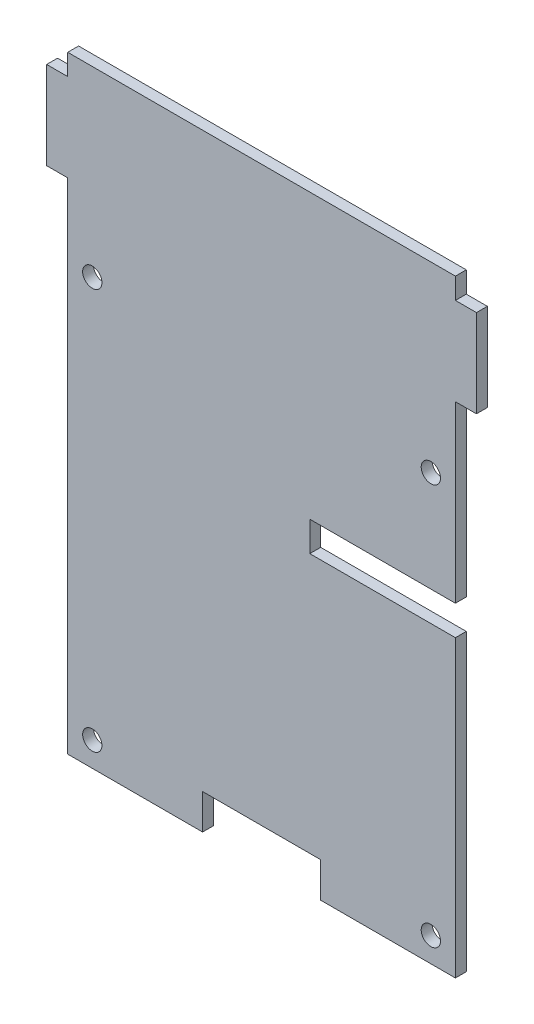
ISO-10303-21;
HEADER;
FILE_DESCRIPTION(('STEP AP214'),'2;1');
FILE_NAME('part.step','',(''),(''),'','','');
FILE_SCHEMA(('AUTOMOTIVE_DESIGN { 1 0 10303 214 1 1 1 1 }'));
ENDSEC;
DATA;
#1=APPLICATION_CONTEXT('core data for automotive mechanical design processes');
#2=APPLICATION_PROTOCOL_DEFINITION('international standard','automotive_design',2000,#1);
#3=PRODUCT_CONTEXT('',#1,'mechanical');
#4=PRODUCT('Part','Part','',(#3));
#5=PRODUCT_RELATED_PRODUCT_CATEGORY('part','',(#4));
#6=PRODUCT_DEFINITION_FORMATION('','',#4);
#7=PRODUCT_DEFINITION_CONTEXT('part definition',#1,'design');
#8=PRODUCT_DEFINITION('design','',#6,#7);
#9=PRODUCT_DEFINITION_SHAPE('','',#8);
#10=(LENGTH_UNIT() NAMED_UNIT(*) SI_UNIT(.MILLI.,.METRE.));
#11=(NAMED_UNIT(*) PLANE_ANGLE_UNIT() SI_UNIT($,.RADIAN.));
#12=(NAMED_UNIT(*) SI_UNIT($,.STERADIAN.) SOLID_ANGLE_UNIT());
#13=UNCERTAINTY_MEASURE_WITH_UNIT(LENGTH_MEASURE(1.E-05),#10,'distance_accuracy_value','');
#14=(GEOMETRIC_REPRESENTATION_CONTEXT(3) GLOBAL_UNCERTAINTY_ASSIGNED_CONTEXT((#13)) GLOBAL_UNIT_ASSIGNED_CONTEXT((#10,
#11,#12)) REPRESENTATION_CONTEXT('',''));
#15=CARTESIAN_POINT('',(0.,0.,0.));
#16=DIRECTION('',(0.,0.,1.));
#17=DIRECTION('',(1.,0.,0.));
#18=AXIS2_PLACEMENT_3D('',#15,#16,#17);
#19=CARTESIAN_POINT('',(3.048,84.963,1.5748));
#20=DIRECTION('',(-1.,0.,0.));
#21=DIRECTION('',(0.,0.,1.));
#22=AXIS2_PLACEMENT_3D('',#19,#20,#21);
#23=PLANE('',#22);
#24=DIRECTION('',(0.,1.,0.));
#25=VECTOR('',#24,1.);
#26=CARTESIAN_POINT('',(3.048,84.963,0.));
#27=LINE('',#26,#25);
#28=CARTESIAN_POINT('',(3.048,72.263,0.));
#29=VERTEX_POINT('',#28);
#30=CARTESIAN_POINT('',(3.048,84.963,0.));
#31=VERTEX_POINT('',#30);
#32=EDGE_CURVE('E161',#29,#31,#27,.T.);
#33=ORIENTED_EDGE('',*,*,#32,.T.);
#34=DIRECTION('',(0.,0.,-1.));
#35=VECTOR('',#34,1.);
#36=CARTESIAN_POINT('',(3.048,84.963,1.5748));
#37=LINE('',#36,#35);
#38=CARTESIAN_POINT('',(3.048,84.963,1.5748));
#39=VERTEX_POINT('',#38);
#40=EDGE_CURVE('E11',#39,#31,#37,.T.);
#41=ORIENTED_EDGE('',*,*,#40,.F.);
#42=DIRECTION('',(0.,1.,0.));
#43=VECTOR('',#42,1.);
#44=CARTESIAN_POINT('',(3.048,84.963,1.5748));
#45=LINE('',#44,#43);
#46=CARTESIAN_POINT('',(3.048,72.263,1.5748));
#47=VERTEX_POINT('',#46);
#48=EDGE_CURVE('E182',#47,#39,#45,.T.);
#49=ORIENTED_EDGE('',*,*,#48,.F.);
#50=DIRECTION('',(0.,0.,-1.));
#51=VECTOR('',#50,1.);
#52=CARTESIAN_POINT('',(3.048,72.263,1.5748));
#53=LINE('',#52,#51);
#54=EDGE_CURVE('E160',#47,#29,#53,.T.);
#55=ORIENTED_EDGE('',*,*,#54,.T.);
#56=EDGE_LOOP('',(#33,#41,#49,#55));
#57=FACE_BOUND('',#56,.T.);
#58=ADVANCED_FACE('F35',(#57),#23,.F.);
#59=CARTESIAN_POINT('',(3.048,84.963,1.5748));
#60=DIRECTION('',(0.,-1.,0.));
#61=DIRECTION('',(0.,0.,-1.));
#62=AXIS2_PLACEMENT_3D('',#59,#60,#61);
#63=PLANE('',#62);
#64=DIRECTION('',(-1.,0.,0.));
#65=VECTOR('',#64,1.);
#66=CARTESIAN_POINT('',(3.048,84.963,0.));
#67=LINE('',#66,#65);
#68=CARTESIAN_POINT('',(0.,84.963,0.));
#69=VERTEX_POINT('',#68);
#70=EDGE_CURVE('E164',#31,#69,#67,.T.);
#71=ORIENTED_EDGE('',*,*,#70,.T.);
#72=DIRECTION('',(0.,0.,-1.));
#73=VECTOR('',#72,1.);
#74=CARTESIAN_POINT('',(0.,84.963,1.5748));
#75=LINE('',#74,#73);
#76=CARTESIAN_POINT('',(0.,84.963,1.5748));
#77=VERTEX_POINT('',#76);
#78=EDGE_CURVE('E43',#77,#69,#75,.T.);
#79=ORIENTED_EDGE('',*,*,#78,.F.);
#80=DIRECTION('',(-1.,0.,0.));
#81=VECTOR('',#80,1.);
#82=CARTESIAN_POINT('',(3.048,84.963,1.5748));
#83=LINE('',#82,#81);
#84=EDGE_CURVE('E101',#39,#77,#83,.T.);
#85=ORIENTED_EDGE('',*,*,#84,.F.);
#86=ORIENTED_EDGE('',*,*,#40,.T.);
#87=EDGE_LOOP('',(#71,#79,#85,#86));
#88=FACE_BOUND('',#87,.T.);
#89=ADVANCED_FACE('F367',(#88),#63,.F.);
#90=CARTESIAN_POINT('',(0.,88.011,1.5748));
#91=DIRECTION('',(-1.,0.,0.));
#92=DIRECTION('',(0.,0.,1.));
#93=AXIS2_PLACEMENT_3D('',#90,#91,#92);
#94=PLANE('',#93);
#95=DIRECTION('',(0.,1.,0.));
#96=VECTOR('',#95,1.);
#97=CARTESIAN_POINT('',(0.,88.011,0.));
#98=LINE('',#97,#96);
#99=CARTESIAN_POINT('',(0.,88.011,0.));
#100=VERTEX_POINT('',#99);
#101=EDGE_CURVE('E167',#69,#100,#98,.T.);
#102=ORIENTED_EDGE('',*,*,#101,.T.);
#103=DIRECTION('',(0.,0.,-1.));
#104=VECTOR('',#103,1.);
#105=CARTESIAN_POINT('',(0.,88.011,1.5748));
#106=LINE('',#105,#104);
#107=CARTESIAN_POINT('',(0.,88.011,1.5748));
#108=VERTEX_POINT('',#107);
#109=EDGE_CURVE('E195',#108,#100,#106,.T.);
#110=ORIENTED_EDGE('',*,*,#109,.F.);
#111=DIRECTION('',(0.,1.,0.));
#112=VECTOR('',#111,1.);
#113=CARTESIAN_POINT('',(0.,88.011,1.5748));
#114=LINE('',#113,#112);
#115=EDGE_CURVE('E203',#77,#108,#114,.T.);
#116=ORIENTED_EDGE('',*,*,#115,.F.);
#117=ORIENTED_EDGE('',*,*,#78,.T.);
#118=EDGE_LOOP('',(#102,#110,#116,#117));
#119=FACE_BOUND('',#118,.T.);
#120=ADVANCED_FACE('F201',(#119),#94,.F.);
#121=CARTESIAN_POINT('',(-56.134,88.011,1.5748));
#122=DIRECTION('',(0.,-1.,0.));
#123=DIRECTION('',(0.,0.,-1.));
#124=AXIS2_PLACEMENT_3D('',#121,#122,#123);
#125=PLANE('',#124);
#126=DIRECTION('',(-1.,0.,0.));
#127=VECTOR('',#126,1.);
#128=CARTESIAN_POINT('',(-56.134,88.011,0.));
#129=LINE('',#128,#127);
#130=CARTESIAN_POINT('',(-56.134,88.011,0.));
#131=VERTEX_POINT('',#130);
#132=EDGE_CURVE('E169',#100,#131,#129,.T.);
#133=ORIENTED_EDGE('',*,*,#132,.T.);
#134=DIRECTION('',(0.,0.,-1.));
#135=VECTOR('',#134,1.);
#136=CARTESIAN_POINT('',(-56.134,88.011,1.5748));
#137=LINE('',#136,#135);
#138=CARTESIAN_POINT('',(-56.134,88.011,1.5748));
#139=VERTEX_POINT('',#138);
#140=EDGE_CURVE('E192',#139,#131,#137,.T.);
#141=ORIENTED_EDGE('',*,*,#140,.F.);
#142=DIRECTION('',(-1.,0.,0.));
#143=VECTOR('',#142,1.);
#144=CARTESIAN_POINT('',(-56.134,88.011,1.5748));
#145=LINE('',#144,#143);
#146=EDGE_CURVE('E222',#108,#139,#145,.T.);
#147=ORIENTED_EDGE('',*,*,#146,.F.);
#148=ORIENTED_EDGE('',*,*,#109,.T.);
#149=EDGE_LOOP('',(#133,#141,#147,#148));
#150=FACE_BOUND('',#149,.T.);
#151=ADVANCED_FACE('F213',(#150),#125,.F.);
#152=CARTESIAN_POINT('',(-56.134,84.963,1.5748));
#153=DIRECTION('',(1.,0.,0.));
#154=DIRECTION('',(0.,0.,-1.));
#155=AXIS2_PLACEMENT_3D('',#152,#153,#154);
#156=PLANE('',#155);
#157=DIRECTION('',(0.,-1.,0.));
#158=VECTOR('',#157,1.);
#159=CARTESIAN_POINT('',(-56.134,84.963,0.));
#160=LINE('',#159,#158);
#161=CARTESIAN_POINT('',(-56.134,84.963,0.));
#162=VERTEX_POINT('',#161);
#163=EDGE_CURVE('E171',#131,#162,#160,.T.);
#164=ORIENTED_EDGE('',*,*,#163,.T.);
#165=DIRECTION('',(0.,0.,-1.));
#166=VECTOR('',#165,1.);
#167=CARTESIAN_POINT('',(-56.134,84.963,1.5748));
#168=LINE('',#167,#166);
#169=CARTESIAN_POINT('',(-56.134,84.963,1.5748));
#170=VERTEX_POINT('',#169);
#171=EDGE_CURVE('E189',#170,#162,#168,.T.);
#172=ORIENTED_EDGE('',*,*,#171,.F.);
#173=DIRECTION('',(0.,-1.,0.));
#174=VECTOR('',#173,1.);
#175=CARTESIAN_POINT('',(-56.134,84.963,1.5748));
#176=LINE('',#175,#174);
#177=EDGE_CURVE('E219',#139,#170,#176,.T.);
#178=ORIENTED_EDGE('',*,*,#177,.F.);
#179=ORIENTED_EDGE('',*,*,#140,.T.);
#180=EDGE_LOOP('',(#164,#172,#178,#179));
#181=FACE_BOUND('',#180,.T.);
#182=ADVANCED_FACE('F217',(#181),#156,.F.);
#183=CARTESIAN_POINT('',(-59.182,84.963,1.5748));
#184=DIRECTION('',(0.,-1.,0.));
#185=DIRECTION('',(0.,0.,-1.));
#186=AXIS2_PLACEMENT_3D('',#183,#184,#185);
#187=PLANE('',#186);
#188=DIRECTION('',(-1.,0.,0.));
#189=VECTOR('',#188,1.);
#190=CARTESIAN_POINT('',(-59.182,84.963,0.));
#191=LINE('',#190,#189);
#192=CARTESIAN_POINT('',(-59.182,84.963,0.));
#193=VERTEX_POINT('',#192);
#194=EDGE_CURVE('E173',#162,#193,#191,.T.);
#195=ORIENTED_EDGE('',*,*,#194,.T.);
#196=DIRECTION('',(0.,0.,-1.));
#197=VECTOR('',#196,1.);
#198=CARTESIAN_POINT('',(-59.182,84.963,1.5748));
#199=LINE('',#198,#197);
#200=CARTESIAN_POINT('',(-59.182,84.963,1.5748));
#201=VERTEX_POINT('',#200);
#202=EDGE_CURVE('E186',#201,#193,#199,.T.);
#203=ORIENTED_EDGE('',*,*,#202,.F.);
#204=DIRECTION('',(-1.,0.,0.));
#205=VECTOR('',#204,1.);
#206=CARTESIAN_POINT('',(-59.182,84.963,1.5748));
#207=LINE('',#206,#205);
#208=EDGE_CURVE('E221',#170,#201,#207,.T.);
#209=ORIENTED_EDGE('',*,*,#208,.F.);
#210=ORIENTED_EDGE('',*,*,#171,.T.);
#211=EDGE_LOOP('',(#195,#203,#209,#210));
#212=FACE_BOUND('',#211,.T.);
#213=ADVANCED_FACE('F543',(#212),#187,.F.);
#214=CARTESIAN_POINT('',(-59.182,84.963,1.5748));
#215=DIRECTION('',(1.,0.,0.));
#216=DIRECTION('',(0.,0.,-1.));
#217=AXIS2_PLACEMENT_3D('',#214,#215,#216);
#218=PLANE('',#217);
#219=DIRECTION('',(0.,-1.,0.));
#220=VECTOR('',#219,1.);
#221=CARTESIAN_POINT('',(-59.182,84.963,0.));
#222=LINE('',#221,#220);
#223=CARTESIAN_POINT('',(-59.182,72.263,0.));
#224=VERTEX_POINT('',#223);
#225=EDGE_CURVE('E175',#193,#224,#222,.T.);
#226=ORIENTED_EDGE('',*,*,#225,.T.);
#227=DIRECTION('',(0.,0.,-1.));
#228=VECTOR('',#227,1.);
#229=CARTESIAN_POINT('',(-59.182,72.263,1.5748));
#230=LINE('',#229,#228);
#231=CARTESIAN_POINT('',(-59.182,72.263,1.5748));
#232=VERTEX_POINT('',#231);
#233=EDGE_CURVE('E147',#232,#224,#230,.T.);
#234=ORIENTED_EDGE('',*,*,#233,.F.);
#235=DIRECTION('',(0.,-1.,0.));
#236=VECTOR('',#235,1.);
#237=CARTESIAN_POINT('',(-59.182,84.963,1.5748));
#238=LINE('',#237,#236);
#239=EDGE_CURVE('E134',#201,#232,#238,.T.);
#240=ORIENTED_EDGE('',*,*,#239,.F.);
#241=ORIENTED_EDGE('',*,*,#202,.T.);
#242=EDGE_LOOP('',(#226,#234,#240,#241));
#243=FACE_BOUND('',#242,.T.);
#244=ADVANCED_FACE('F540',(#243),#218,.F.);
#245=CARTESIAN_POINT('',(-59.182,72.263,1.5748));
#246=DIRECTION('',(0.,1.,0.));
#247=DIRECTION('',(0.,0.,1.));
#248=AXIS2_PLACEMENT_3D('',#245,#246,#247);
#249=PLANE('',#248);
#250=DIRECTION('',(1.,0.,0.));
#251=VECTOR('',#250,1.);
#252=CARTESIAN_POINT('',(-59.182,72.263,0.));
#253=LINE('',#252,#251);
#254=CARTESIAN_POINT('',(-56.134,72.263,0.));
#255=VERTEX_POINT('',#254);
#256=EDGE_CURVE('E143',#224,#255,#253,.T.);
#257=ORIENTED_EDGE('',*,*,#256,.T.);
#258=DIRECTION('',(0.,0.,-1.));
#259=VECTOR('',#258,1.);
#260=CARTESIAN_POINT('',(-56.134,72.263,1.5748));
#261=LINE('',#260,#259);
#262=CARTESIAN_POINT('',(-56.134,72.263,1.5748));
#263=VERTEX_POINT('',#262);
#264=EDGE_CURVE('E140',#263,#255,#261,.T.);
#265=ORIENTED_EDGE('',*,*,#264,.F.);
#266=DIRECTION('',(1.,0.,0.));
#267=VECTOR('',#266,1.);
#268=CARTESIAN_POINT('',(-59.182,72.263,1.5748));
#269=LINE('',#268,#267);
#270=EDGE_CURVE('E124',#232,#263,#269,.T.);
#271=ORIENTED_EDGE('',*,*,#270,.F.);
#272=ORIENTED_EDGE('',*,*,#233,.T.);
#273=EDGE_LOOP('',(#257,#265,#271,#272));
#274=FACE_BOUND('',#273,.T.);
#275=ADVANCED_FACE('F141',(#274),#249,.F.);
#276=CARTESIAN_POINT('',(-56.134,64.77,1.5748));
#277=DIRECTION('',(1.,0.,0.));
#278=DIRECTION('',(0.,0.,-1.));
#279=AXIS2_PLACEMENT_3D('',#276,#277,#278);
#280=PLANE('',#279);
#281=DIRECTION('',(0.,-1.,0.));
#282=VECTOR('',#281,1.);
#283=CARTESIAN_POINT('',(-56.134,64.77,0.));
#284=LINE('',#283,#282);
#285=CARTESIAN_POINT('',(-56.134,0.,0.));
#286=VERTEX_POINT('',#285);
#287=EDGE_CURVE('E178',#255,#286,#284,.T.);
#288=ORIENTED_EDGE('',*,*,#287,.T.);
#289=DIRECTION('',(0.,0.,1.));
#290=VECTOR('',#289,1.);
#291=CARTESIAN_POINT('',(-56.134,0.,0.));
#292=LINE('',#291,#290);
#293=CARTESIAN_POINT('',(-56.134,0.,1.5748));
#294=VERTEX_POINT('',#293);
#295=EDGE_CURVE('E152',#286,#294,#292,.T.);
#296=ORIENTED_EDGE('',*,*,#295,.T.);
#297=DIRECTION('',(0.,-1.,0.));
#298=VECTOR('',#297,1.);
#299=CARTESIAN_POINT('',(-56.134,64.77,1.5748));
#300=LINE('',#299,#298);
#301=EDGE_CURVE('E131',#263,#294,#300,.T.);
#302=ORIENTED_EDGE('',*,*,#301,.F.);
#303=ORIENTED_EDGE('',*,*,#264,.T.);
#304=EDGE_LOOP('',(#288,#296,#302,#303));
#305=FACE_BOUND('',#304,.T.);
#306=ADVANCED_FACE('F150',(#305),#280,.F.);
#307=CARTESIAN_POINT('',(0.,72.263,1.5748));
#308=DIRECTION('',(-1.,0.,0.));
#309=DIRECTION('',(0.,0.,1.));
#310=AXIS2_PLACEMENT_3D('',#307,#308,#309);
#311=PLANE('',#310);
#312=DIRECTION('',(0.,1.,0.));
#313=VECTOR('',#312,1.);
#314=CARTESIAN_POINT('',(0.,72.263,0.));
#315=LINE('',#314,#313);
#316=CARTESIAN_POINT('',(0.,46.99,0.));
#317=VERTEX_POINT('',#316);
#318=CARTESIAN_POINT('',(0.,72.263,0.));
#319=VERTEX_POINT('',#318);
#320=EDGE_CURVE('E87',#317,#319,#315,.T.);
#321=ORIENTED_EDGE('',*,*,#320,.T.);
#322=DIRECTION('',(0.,0.,-1.));
#323=VECTOR('',#322,1.);
#324=CARTESIAN_POINT('',(0.,72.263,1.5748));
#325=LINE('',#324,#323);
#326=CARTESIAN_POINT('',(0.,72.263,1.5748));
#327=VERTEX_POINT('',#326);
#328=EDGE_CURVE('E148',#327,#319,#325,.T.);
#329=ORIENTED_EDGE('',*,*,#328,.F.);
#330=DIRECTION('',(0.,1.,0.));
#331=VECTOR('',#330,1.);
#332=CARTESIAN_POINT('',(0.,72.263,1.5748));
#333=LINE('',#332,#331);
#334=CARTESIAN_POINT('',(0.,46.99,1.5748));
#335=VERTEX_POINT('',#334);
#336=EDGE_CURVE('E154',#335,#327,#333,.T.);
#337=ORIENTED_EDGE('',*,*,#336,.F.);
#338=DIRECTION('',(0.,0.,1.));
#339=VECTOR('',#338,1.);
#340=CARTESIAN_POINT('',(0.,46.99,0.));
#341=LINE('',#340,#339);
#342=EDGE_CURVE('E237',#317,#335,#341,.T.);
#343=ORIENTED_EDGE('',*,*,#342,.F.);
#344=EDGE_LOOP('',(#321,#329,#337,#343));
#345=FACE_BOUND('',#344,.T.);
#346=ADVANCED_FACE('F381',(#345),#311,.F.);
#347=CARTESIAN_POINT('',(3.048,72.263,1.5748));
#348=DIRECTION('',(0.,1.,0.));
#349=DIRECTION('',(0.,0.,1.));
#350=AXIS2_PLACEMENT_3D('',#347,#348,#349);
#351=PLANE('',#350);
#352=DIRECTION('',(1.,0.,0.));
#353=VECTOR('',#352,1.);
#354=CARTESIAN_POINT('',(3.048,72.263,0.));
#355=LINE('',#354,#353);
#356=EDGE_CURVE('E93',#319,#29,#355,.T.);
#357=ORIENTED_EDGE('',*,*,#356,.T.);
#358=ORIENTED_EDGE('',*,*,#54,.F.);
#359=DIRECTION('',(1.,0.,0.));
#360=VECTOR('',#359,1.);
#361=CARTESIAN_POINT('',(3.048,72.263,1.5748));
#362=LINE('',#361,#360);
#363=EDGE_CURVE('E51',#327,#47,#362,.T.);
#364=ORIENTED_EDGE('',*,*,#363,.F.);
#365=ORIENTED_EDGE('',*,*,#328,.T.);
#366=EDGE_LOOP('',(#357,#358,#364,#365));
#367=FACE_BOUND('',#366,.T.);
#368=ADVANCED_FACE('F341',(#367),#351,.F.);
#369=CARTESIAN_POINT('',(0.,0.,1.5748));
#370=DIRECTION('',(0.,0.,-1.));
#371=DIRECTION('',(-1.,0.,0.));
#372=AXIS2_PLACEMENT_3D('',#369,#370,#371);
#373=PLANE('',#372);
#374=ORIENTED_EDGE('',*,*,#48,.T.);
#375=ORIENTED_EDGE('',*,*,#84,.T.);
#376=ORIENTED_EDGE('',*,*,#115,.T.);
#377=ORIENTED_EDGE('',*,*,#146,.T.);
#378=ORIENTED_EDGE('',*,*,#177,.T.);
#379=ORIENTED_EDGE('',*,*,#208,.T.);
#380=ORIENTED_EDGE('',*,*,#239,.T.);
#381=ORIENTED_EDGE('',*,*,#270,.T.);
#382=ORIENTED_EDGE('',*,*,#301,.T.);
#383=DIRECTION('',(1.,0.,0.));
#384=VECTOR('',#383,1.);
#385=CARTESIAN_POINT('',(0.,0.,1.5748));
#386=LINE('',#385,#384);
#387=CARTESIAN_POINT('',(-36.6014,0.,1.5748));
#388=VERTEX_POINT('',#387);
#389=EDGE_CURVE('E268',#294,#388,#386,.T.);
#390=ORIENTED_EDGE('',*,*,#389,.T.);
#391=DIRECTION('',(0.,-1.,0.));
#392=VECTOR('',#391,1.);
#393=CARTESIAN_POINT('',(-36.6014,0.,1.5748));
#394=LINE('',#393,#392);
#395=CARTESIAN_POINT('',(-36.6014,5.08,1.5748));
#396=VERTEX_POINT('',#395);
#397=EDGE_CURVE('E265',#396,#388,#394,.T.);
#398=ORIENTED_EDGE('',*,*,#397,.F.);
#399=DIRECTION('',(1.,0.,0.));
#400=VECTOR('',#399,1.);
#401=CARTESIAN_POINT('',(0.,5.08,1.5748));
#402=LINE('',#401,#400);
#403=CARTESIAN_POINT('',(-19.558,5.08,1.5748));
#404=VERTEX_POINT('',#403);
#405=EDGE_CURVE('E262',#396,#404,#402,.T.);
#406=ORIENTED_EDGE('',*,*,#405,.T.);
#407=DIRECTION('',(0.,-1.,0.));
#408=VECTOR('',#407,1.);
#409=CARTESIAN_POINT('',(-19.558,0.,1.5748));
#410=LINE('',#409,#408);
#411=CARTESIAN_POINT('',(-19.558,0.,1.5748));
#412=VERTEX_POINT('',#411);
#413=EDGE_CURVE('E258',#404,#412,#410,.T.);
#414=ORIENTED_EDGE('',*,*,#413,.T.);
#415=CARTESIAN_POINT('',(0.,0.,1.5748));
#416=VERTEX_POINT('',#415);
#417=EDGE_CURVE('E261',#412,#416,#386,.T.);
#418=ORIENTED_EDGE('',*,*,#417,.T.);
#419=DIRECTION('',(0.,-1.,0.));
#420=VECTOR('',#419,1.);
#421=CARTESIAN_POINT('',(0.,0.,1.5748));
#422=LINE('',#421,#420);
#423=CARTESIAN_POINT('',(0.,42.672,1.5748));
#424=VERTEX_POINT('',#423);
#425=EDGE_CURVE('E271',#424,#416,#422,.T.);
#426=ORIENTED_EDGE('',*,*,#425,.F.);
#427=DIRECTION('',(1.,0.,0.));
#428=VECTOR('',#427,1.);
#429=CARTESIAN_POINT('',(0.,42.672,1.5748));
#430=LINE('',#429,#428);
#431=CARTESIAN_POINT('',(-21.082,42.672,1.5748));
#432=VERTEX_POINT('',#431);
#433=EDGE_CURVE('E280',#432,#424,#430,.T.);
#434=ORIENTED_EDGE('',*,*,#433,.F.);
#435=DIRECTION('',(0.,-1.,0.));
#436=VECTOR('',#435,1.);
#437=CARTESIAN_POINT('',(-21.082,0.,1.5748));
#438=LINE('',#437,#436);
#439=CARTESIAN_POINT('',(-21.082,46.99,1.5748));
#440=VERTEX_POINT('',#439);
#441=EDGE_CURVE('E277',#440,#432,#438,.T.);
#442=ORIENTED_EDGE('',*,*,#441,.F.);
#443=DIRECTION('',(-1.,0.,0.));
#444=VECTOR('',#443,1.);
#445=CARTESIAN_POINT('',(0.,46.99,1.5748));
#446=LINE('',#445,#444);
#447=EDGE_CURVE('E270',#335,#440,#446,.T.);
#448=ORIENTED_EDGE('',*,*,#447,.F.);
#449=ORIENTED_EDGE('',*,*,#336,.T.);
#450=ORIENTED_EDGE('',*,*,#363,.T.);
#451=EDGE_LOOP('',(#374,#375,#376,#377,#378,#379,#380,#381,#382,#390,#398,#406,#414,#418,#426,
#434,#442,#448,#449,#450));
#452=FACE_BOUND('',#451,.T.);
#453=CARTESIAN_POINT('',(-52.578,3.556,1.5748));
#454=DIRECTION('',(0.,0.,1.));
#455=DIRECTION('',(1.,0.,0.));
#456=AXIS2_PLACEMENT_3D('',#453,#454,#455);
#457=CIRCLE('',#456,1.39699999999999);
#458=CARTESIAN_POINT('',(-51.181,3.556,1.5748));
#459=VERTEX_POINT('',#458);
#460=EDGE_CURVE('E292',#459,#459,#457,.T.);
#461=ORIENTED_EDGE('',*,*,#460,.F.);
#462=EDGE_LOOP('',(#461));
#463=FACE_BOUND('',#462,.T.);
#464=CARTESIAN_POINT('',(-3.556,3.556,1.5748));
#465=DIRECTION('',(0.,0.,1.));
#466=DIRECTION('',(1.,0.,0.));
#467=AXIS2_PLACEMENT_3D('',#464,#465,#466);
#468=CIRCLE('',#467,1.397);
#469=CARTESIAN_POINT('',(-2.159,3.556,1.5748));
#470=VERTEX_POINT('',#469);
#471=EDGE_CURVE('E289',#470,#470,#468,.T.);
#472=ORIENTED_EDGE('',*,*,#471,.F.);
#473=EDGE_LOOP('',(#472));
#474=FACE_BOUND('',#473,.T.);
#475=CARTESIAN_POINT('',(-3.556,61.595,1.5748));
#476=DIRECTION('',(0.,0.,1.));
#477=DIRECTION('',(1.,0.,0.));
#478=AXIS2_PLACEMENT_3D('',#475,#476,#477);
#479=CIRCLE('',#478,1.397);
#480=CARTESIAN_POINT('',(-2.159,61.595,1.5748));
#481=VERTEX_POINT('',#480);
#482=EDGE_CURVE('E286',#481,#481,#479,.T.);
#483=ORIENTED_EDGE('',*,*,#482,.F.);
#484=EDGE_LOOP('',(#483));
#485=FACE_BOUND('',#484,.T.);
#486=CARTESIAN_POINT('',(-52.578,61.595,1.5748));
#487=DIRECTION('',(0.,0.,1.));
#488=DIRECTION('',(1.,0.,0.));
#489=AXIS2_PLACEMENT_3D('',#486,#487,#488);
#490=CIRCLE('',#489,1.397);
#491=CARTESIAN_POINT('',(-51.181,61.595,1.5748));
#492=VERTEX_POINT('',#491);
#493=EDGE_CURVE('E283',#492,#492,#490,.T.);
#494=ORIENTED_EDGE('',*,*,#493,.F.);
#495=EDGE_LOOP('',(#494));
#496=FACE_BOUND('',#495,.T.);
#497=ADVANCED_FACE('F126',(#452,#463,#474,#485,#496),#373,.F.);
#498=CARTESIAN_POINT('',(0.,0.,0.));
#499=DIRECTION('',(0.,0.,-1.));
#500=DIRECTION('',(-1.,0.,0.));
#501=AXIS2_PLACEMENT_3D('',#498,#499,#500);
#502=PLANE('',#501);
#503=ORIENTED_EDGE('',*,*,#32,.F.);
#504=ORIENTED_EDGE('',*,*,#356,.F.);
#505=ORIENTED_EDGE('',*,*,#320,.F.);
#506=DIRECTION('',(-1.,0.,0.));
#507=VECTOR('',#506,1.);
#508=CARTESIAN_POINT('',(0.,46.99,0.));
#509=LINE('',#508,#507);
#510=CARTESIAN_POINT('',(-21.082,46.99,0.));
#511=VERTEX_POINT('',#510);
#512=EDGE_CURVE('E308',#317,#511,#509,.T.);
#513=ORIENTED_EDGE('',*,*,#512,.T.);
#514=DIRECTION('',(0.,-1.,0.));
#515=VECTOR('',#514,1.);
#516=CARTESIAN_POINT('',(-21.082,0.,0.));
#517=LINE('',#516,#515);
#518=CARTESIAN_POINT('',(-21.082,42.672,0.));
#519=VERTEX_POINT('',#518);
#520=EDGE_CURVE('E313',#511,#519,#517,.T.);
#521=ORIENTED_EDGE('',*,*,#520,.T.);
#522=DIRECTION('',(1.,0.,0.));
#523=VECTOR('',#522,1.);
#524=CARTESIAN_POINT('',(0.,42.672,0.));
#525=LINE('',#524,#523);
#526=CARTESIAN_POINT('',(0.,42.672,0.));
#527=VERTEX_POINT('',#526);
#528=EDGE_CURVE('E316',#519,#527,#525,.T.);
#529=ORIENTED_EDGE('',*,*,#528,.T.);
#530=DIRECTION('',(0.,-1.,0.));
#531=VECTOR('',#530,1.);
#532=CARTESIAN_POINT('',(0.,0.,0.));
#533=LINE('',#532,#531);
#534=CARTESIAN_POINT('',(0.,0.,0.));
#535=VERTEX_POINT('',#534);
#536=EDGE_CURVE('E234',#527,#535,#533,.T.);
#537=ORIENTED_EDGE('',*,*,#536,.T.);
#538=DIRECTION('',(1.,0.,0.));
#539=VECTOR('',#538,1.);
#540=CARTESIAN_POINT('',(0.,0.,0.));
#541=LINE('',#540,#539);
#542=CARTESIAN_POINT('',(-19.558,0.,0.));
#543=VERTEX_POINT('',#542);
#544=EDGE_CURVE('E298',#543,#535,#541,.T.);
#545=ORIENTED_EDGE('',*,*,#544,.F.);
#546=DIRECTION('',(0.,-1.,0.));
#547=VECTOR('',#546,1.);
#548=CARTESIAN_POINT('',(-19.558,0.,0.));
#549=LINE('',#548,#547);
#550=CARTESIAN_POINT('',(-19.558,5.08,0.));
#551=VERTEX_POINT('',#550);
#552=EDGE_CURVE('E295',#551,#543,#549,.T.);
#553=ORIENTED_EDGE('',*,*,#552,.F.);
#554=DIRECTION('',(1.,0.,0.));
#555=VECTOR('',#554,1.);
#556=CARTESIAN_POINT('',(0.,5.08,0.));
#557=LINE('',#556,#555);
#558=CARTESIAN_POINT('',(-36.6014,5.08,0.));
#559=VERTEX_POINT('',#558);
#560=EDGE_CURVE('E299',#559,#551,#557,.T.);
#561=ORIENTED_EDGE('',*,*,#560,.F.);
#562=DIRECTION('',(0.,-1.,0.));
#563=VECTOR('',#562,1.);
#564=CARTESIAN_POINT('',(-36.6014,0.,0.));
#565=LINE('',#564,#563);
#566=CARTESIAN_POINT('',(-36.6014,0.,0.));
#567=VERTEX_POINT('',#566);
#568=EDGE_CURVE('E302',#559,#567,#565,.T.);
#569=ORIENTED_EDGE('',*,*,#568,.T.);
#570=EDGE_CURVE('E305',#286,#567,#541,.T.);
#571=ORIENTED_EDGE('',*,*,#570,.F.);
#572=ORIENTED_EDGE('',*,*,#287,.F.);
#573=ORIENTED_EDGE('',*,*,#256,.F.);
#574=ORIENTED_EDGE('',*,*,#225,.F.);
#575=ORIENTED_EDGE('',*,*,#194,.F.);
#576=ORIENTED_EDGE('',*,*,#163,.F.);
#577=ORIENTED_EDGE('',*,*,#132,.F.);
#578=ORIENTED_EDGE('',*,*,#101,.F.);
#579=ORIENTED_EDGE('',*,*,#70,.F.);
#580=EDGE_LOOP('',(#503,#504,#505,#513,#521,#529,#537,#545,#553,#561,#569,#571,#572,#573,#574,
#575,#576,#577,#578,#579));
#581=FACE_BOUND('',#580,.T.);
#582=CARTESIAN_POINT('',(-52.578,3.556,0.));
#583=DIRECTION('',(0.,0.,1.));
#584=DIRECTION('',(1.,0.,0.));
#585=AXIS2_PLACEMENT_3D('',#582,#583,#584);
#586=CIRCLE('',#585,1.39699999999999);
#587=CARTESIAN_POINT('',(-51.181,3.556,0.));
#588=VERTEX_POINT('',#587);
#589=EDGE_CURVE('E274',#588,#588,#586,.T.);
#590=ORIENTED_EDGE('',*,*,#589,.T.);
#591=EDGE_LOOP('',(#590));
#592=FACE_BOUND('',#591,.T.);
#593=CARTESIAN_POINT('',(-3.556,3.556,0.));
#594=DIRECTION('',(0.,0.,1.));
#595=DIRECTION('',(1.,0.,0.));
#596=AXIS2_PLACEMENT_3D('',#593,#594,#595);
#597=CIRCLE('',#596,1.397);
#598=CARTESIAN_POINT('',(-2.159,3.556,0.));
#599=VERTEX_POINT('',#598);
#600=EDGE_CURVE('E325',#599,#599,#597,.T.);
#601=ORIENTED_EDGE('',*,*,#600,.T.);
#602=EDGE_LOOP('',(#601));
#603=FACE_BOUND('',#602,.T.);
#604=CARTESIAN_POINT('',(-3.556,61.595,0.));
#605=DIRECTION('',(0.,0.,1.));
#606=DIRECTION('',(1.,0.,0.));
#607=AXIS2_PLACEMENT_3D('',#604,#605,#606);
#608=CIRCLE('',#607,1.397);
#609=CARTESIAN_POINT('',(-2.159,61.595,0.));
#610=VERTEX_POINT('',#609);
#611=EDGE_CURVE('E322',#610,#610,#608,.T.);
#612=ORIENTED_EDGE('',*,*,#611,.T.);
#613=EDGE_LOOP('',(#612));
#614=FACE_BOUND('',#613,.T.);
#615=CARTESIAN_POINT('',(-52.578,61.595,0.));
#616=DIRECTION('',(0.,0.,1.));
#617=DIRECTION('',(1.,0.,0.));
#618=AXIS2_PLACEMENT_3D('',#615,#616,#617);
#619=CIRCLE('',#618,1.397);
#620=CARTESIAN_POINT('',(-51.181,61.595,0.));
#621=VERTEX_POINT('',#620);
#622=EDGE_CURVE('E319',#621,#621,#619,.T.);
#623=ORIENTED_EDGE('',*,*,#622,.T.);
#624=EDGE_LOOP('',(#623));
#625=FACE_BOUND('',#624,.T.);
#626=ADVANCED_FACE('F207',(#581,#592,#603,#614,#625),#502,.T.);
#627=CARTESIAN_POINT('',(0.,42.672,0.));
#628=DIRECTION('',(0.,-1.,0.));
#629=DIRECTION('',(0.,0.,-1.));
#630=AXIS2_PLACEMENT_3D('',#627,#628,#629);
#631=PLANE('',#630);
#632=ORIENTED_EDGE('',*,*,#433,.T.);
#633=DIRECTION('',(0.,0.,1.));
#634=VECTOR('',#633,1.);
#635=CARTESIAN_POINT('',(0.,42.672,0.));
#636=LINE('',#635,#634);
#637=EDGE_CURVE('E165',#527,#424,#636,.T.);
#638=ORIENTED_EDGE('',*,*,#637,.F.);
#639=ORIENTED_EDGE('',*,*,#528,.F.);
#640=DIRECTION('',(0.,0.,1.));
#641=VECTOR('',#640,1.);
#642=CARTESIAN_POINT('',(-21.082,42.672,0.));
#643=LINE('',#642,#641);
#644=EDGE_CURVE('E230',#519,#432,#643,.T.);
#645=ORIENTED_EDGE('',*,*,#644,.T.);
#646=EDGE_LOOP('',(#632,#638,#639,#645));
#647=FACE_BOUND('',#646,.T.);
#648=ADVANCED_FACE('F463',(#647),#631,.F.);
#649=CARTESIAN_POINT('',(0.,0.,0.));
#650=DIRECTION('',(-1.,0.,0.));
#651=DIRECTION('',(0.,0.,1.));
#652=AXIS2_PLACEMENT_3D('',#649,#650,#651);
#653=PLANE('',#652);
#654=ORIENTED_EDGE('',*,*,#425,.T.);
#655=DIRECTION('',(0.,0.,1.));
#656=VECTOR('',#655,1.);
#657=CARTESIAN_POINT('',(0.,0.,0.));
#658=LINE('',#657,#656);
#659=EDGE_CURVE('E253',#535,#416,#658,.T.);
#660=ORIENTED_EDGE('',*,*,#659,.F.);
#661=ORIENTED_EDGE('',*,*,#536,.F.);
#662=ORIENTED_EDGE('',*,*,#637,.T.);
#663=EDGE_LOOP('',(#654,#660,#661,#662));
#664=FACE_BOUND('',#663,.T.);
#665=ADVANCED_FACE('F433',(#664),#653,.F.);
#666=CARTESIAN_POINT('',(0.,0.,0.));
#667=DIRECTION('',(0.,-1.,0.));
#668=DIRECTION('',(0.,0.,-1.));
#669=AXIS2_PLACEMENT_3D('',#666,#667,#668);
#670=PLANE('',#669);
#671=ORIENTED_EDGE('',*,*,#417,.F.);
#672=DIRECTION('',(0.,0.,1.));
#673=VECTOR('',#672,1.);
#674=CARTESIAN_POINT('',(-19.558,0.,0.));
#675=LINE('',#674,#673);
#676=EDGE_CURVE('E250',#543,#412,#675,.T.);
#677=ORIENTED_EDGE('',*,*,#676,.F.);
#678=ORIENTED_EDGE('',*,*,#544,.T.);
#679=ORIENTED_EDGE('',*,*,#659,.T.);
#680=EDGE_LOOP('',(#671,#677,#678,#679));
#681=FACE_BOUND('',#680,.T.);
#682=ADVANCED_FACE('F429',(#681),#670,.T.);
#683=CARTESIAN_POINT('',(-19.558,0.,0.));
#684=DIRECTION('',(-1.,0.,0.));
#685=DIRECTION('',(0.,0.,1.));
#686=AXIS2_PLACEMENT_3D('',#683,#684,#685);
#687=PLANE('',#686);
#688=ORIENTED_EDGE('',*,*,#413,.F.);
#689=DIRECTION('',(0.,0.,1.));
#690=VECTOR('',#689,1.);
#691=CARTESIAN_POINT('',(-19.558,5.08,0.));
#692=LINE('',#691,#690);
#693=EDGE_CURVE('E247',#551,#404,#692,.T.);
#694=ORIENTED_EDGE('',*,*,#693,.F.);
#695=ORIENTED_EDGE('',*,*,#552,.T.);
#696=ORIENTED_EDGE('',*,*,#676,.T.);
#697=EDGE_LOOP('',(#688,#694,#695,#696));
#698=FACE_BOUND('',#697,.T.);
#699=ADVANCED_FACE('F439',(#698),#687,.T.);
#700=CARTESIAN_POINT('',(0.,5.08,0.));
#701=DIRECTION('',(0.,-1.,0.));
#702=DIRECTION('',(1.,0.,0.));
#703=AXIS2_PLACEMENT_3D('',#700,#701,#702);
#704=PLANE('',#703);
#705=ORIENTED_EDGE('',*,*,#405,.F.);
#706=DIRECTION('',(0.,0.,1.));
#707=VECTOR('',#706,1.);
#708=CARTESIAN_POINT('',(-36.6014,5.08,0.));
#709=LINE('',#708,#707);
#710=EDGE_CURVE('E244',#559,#396,#709,.T.);
#711=ORIENTED_EDGE('',*,*,#710,.F.);
#712=ORIENTED_EDGE('',*,*,#560,.T.);
#713=ORIENTED_EDGE('',*,*,#693,.T.);
#714=EDGE_LOOP('',(#705,#711,#712,#713));
#715=FACE_BOUND('',#714,.T.);
#716=ADVANCED_FACE('F443',(#715),#704,.T.);
#717=CARTESIAN_POINT('',(-36.6014,0.,0.));
#718=DIRECTION('',(-1.,0.,0.));
#719=DIRECTION('',(0.,0.,1.));
#720=AXIS2_PLACEMENT_3D('',#717,#718,#719);
#721=PLANE('',#720);
#722=ORIENTED_EDGE('',*,*,#397,.T.);
#723=DIRECTION('',(0.,0.,1.));
#724=VECTOR('',#723,1.);
#725=CARTESIAN_POINT('',(-36.6014,0.,0.));
#726=LINE('',#725,#724);
#727=EDGE_CURVE('E241',#567,#388,#726,.T.);
#728=ORIENTED_EDGE('',*,*,#727,.F.);
#729=ORIENTED_EDGE('',*,*,#568,.F.);
#730=ORIENTED_EDGE('',*,*,#710,.T.);
#731=EDGE_LOOP('',(#722,#728,#729,#730));
#732=FACE_BOUND('',#731,.T.);
#733=ADVANCED_FACE('F447',(#732),#721,.F.);
#734=ORIENTED_EDGE('',*,*,#389,.F.);
#735=ORIENTED_EDGE('',*,*,#295,.F.);
#736=ORIENTED_EDGE('',*,*,#570,.T.);
#737=ORIENTED_EDGE('',*,*,#727,.T.);
#738=EDGE_LOOP('',(#734,#735,#736,#737));
#739=FACE_BOUND('',#738,.T.);
#740=ADVANCED_FACE('F361',(#739),#670,.T.);
#741=CARTESIAN_POINT('',(0.,46.99,0.));
#742=DIRECTION('',(0.,1.,0.));
#743=DIRECTION('',(0.,0.,1.));
#744=AXIS2_PLACEMENT_3D('',#741,#742,#743);
#745=PLANE('',#744);
#746=ORIENTED_EDGE('',*,*,#447,.T.);
#747=DIRECTION('',(0.,0.,1.));
#748=VECTOR('',#747,1.);
#749=CARTESIAN_POINT('',(-21.082,46.99,0.));
#750=LINE('',#749,#748);
#751=EDGE_CURVE('E233',#511,#440,#750,.T.);
#752=ORIENTED_EDGE('',*,*,#751,.F.);
#753=ORIENTED_EDGE('',*,*,#512,.F.);
#754=ORIENTED_EDGE('',*,*,#342,.T.);
#755=EDGE_LOOP('',(#746,#752,#753,#754));
#756=FACE_BOUND('',#755,.T.);
#757=ADVANCED_FACE('F352',(#756),#745,.F.);
#758=CARTESIAN_POINT('',(-52.578,61.595,0.));
#759=DIRECTION('',(0.,0.,1.));
#760=DIRECTION('',(1.,0.,0.));
#761=AXIS2_PLACEMENT_3D('',#758,#759,#760);
#762=CYLINDRICAL_SURFACE('',#761,1.397);
#763=ORIENTED_EDGE('',*,*,#622,.F.);
#764=EDGE_LOOP('',(#763));
#765=FACE_BOUND('',#764,.T.);
#766=ORIENTED_EDGE('',*,*,#493,.T.);
#767=EDGE_LOOP('',(#766));
#768=FACE_BOUND('',#767,.T.);
#769=ADVANCED_FACE('F349',(#765,#768),#762,.F.);
#770=CARTESIAN_POINT('',(-3.556,61.595,0.));
#771=DIRECTION('',(0.,0.,1.));
#772=DIRECTION('',(1.,0.,0.));
#773=AXIS2_PLACEMENT_3D('',#770,#771,#772);
#774=CYLINDRICAL_SURFACE('',#773,1.397);
#775=ORIENTED_EDGE('',*,*,#611,.F.);
#776=EDGE_LOOP('',(#775));
#777=FACE_BOUND('',#776,.T.);
#778=ORIENTED_EDGE('',*,*,#482,.T.);
#779=EDGE_LOOP('',(#778));
#780=FACE_BOUND('',#779,.T.);
#781=ADVANCED_FACE('F351',(#777,#780),#774,.F.);
#782=CARTESIAN_POINT('',(-3.556,3.556,0.));
#783=DIRECTION('',(0.,0.,1.));
#784=DIRECTION('',(1.,0.,0.));
#785=AXIS2_PLACEMENT_3D('',#782,#783,#784);
#786=CYLINDRICAL_SURFACE('',#785,1.397);
#787=ORIENTED_EDGE('',*,*,#600,.F.);
#788=EDGE_LOOP('',(#787));
#789=FACE_BOUND('',#788,.T.);
#790=ORIENTED_EDGE('',*,*,#471,.T.);
#791=EDGE_LOOP('',(#790));
#792=FACE_BOUND('',#791,.T.);
#793=ADVANCED_FACE('F336',(#789,#792),#786,.F.);
#794=CARTESIAN_POINT('',(-52.578,3.556,0.));
#795=DIRECTION('',(0.,0.,1.));
#796=DIRECTION('',(1.,0.,0.));
#797=AXIS2_PLACEMENT_3D('',#794,#795,#796);
#798=CYLINDRICAL_SURFACE('',#797,1.39699999999999);
#799=ORIENTED_EDGE('',*,*,#589,.F.);
#800=EDGE_LOOP('',(#799));
#801=FACE_BOUND('',#800,.T.);
#802=ORIENTED_EDGE('',*,*,#460,.T.);
#803=EDGE_LOOP('',(#802));
#804=FACE_BOUND('',#803,.T.);
#805=ADVANCED_FACE('F332',(#801,#804),#798,.F.);
#806=CARTESIAN_POINT('',(-21.082,0.,0.));
#807=DIRECTION('',(-1.,0.,0.));
#808=DIRECTION('',(0.,0.,1.));
#809=AXIS2_PLACEMENT_3D('',#806,#807,#808);
#810=PLANE('',#809);
#811=ORIENTED_EDGE('',*,*,#441,.T.);
#812=ORIENTED_EDGE('',*,*,#644,.F.);
#813=ORIENTED_EDGE('',*,*,#520,.F.);
#814=ORIENTED_EDGE('',*,*,#751,.T.);
#815=EDGE_LOOP('',(#811,#812,#813,#814));
#816=FACE_BOUND('',#815,.T.);
#817=ADVANCED_FACE('F335',(#816),#810,.F.);
#818=CLOSED_SHELL('',(#58,#89,#120,#151,#182,#213,#244,#275,#306,#346,#368,#497,#626,#648,#665,
#682,#699,#716,#733,#740,#757,#769,#781,#793,#805,#817));
#819=MANIFOLD_SOLID_BREP('B2',#818);
#820=ADVANCED_BREP_SHAPE_REPRESENTATION('',(#18,#819),#14);
#821=SHAPE_DEFINITION_REPRESENTATION(#9,#820);
ENDSEC;
END-ISO-10303-21;
